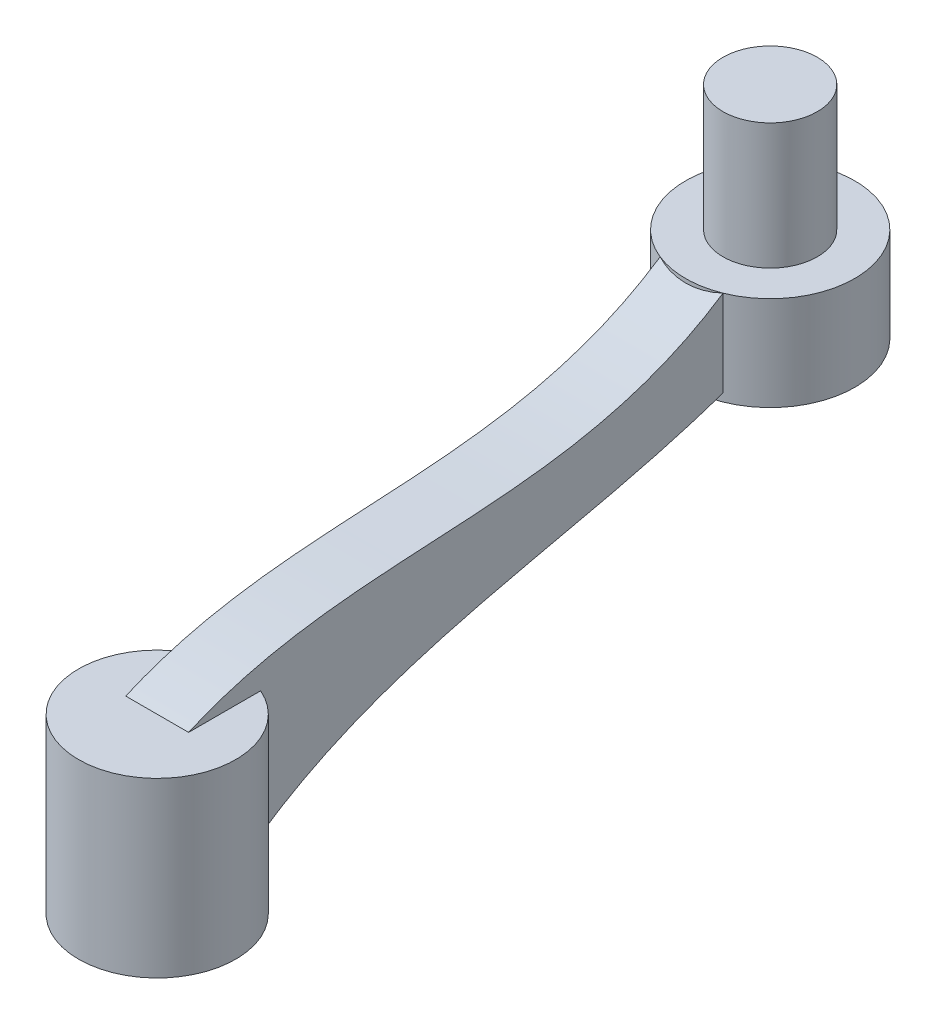
ISO-10303-21;
HEADER;
FILE_DESCRIPTION(('STEP AP214'),'2;1');
FILE_NAME('part.step','',(''),(''),'','','');
FILE_SCHEMA(('AUTOMOTIVE_DESIGN { 1 0 10303 214 1 1 1 1 }'));
ENDSEC;
DATA;
#1=APPLICATION_CONTEXT('core data for automotive mechanical design processes');
#2=APPLICATION_PROTOCOL_DEFINITION('international standard','automotive_design',2000,#1);
#3=PRODUCT_CONTEXT('',#1,'mechanical');
#4=PRODUCT('Part','Part','',(#3));
#5=PRODUCT_RELATED_PRODUCT_CATEGORY('part','',(#4));
#6=PRODUCT_DEFINITION_FORMATION('','',#4);
#7=PRODUCT_DEFINITION_CONTEXT('part definition',#1,'design');
#8=PRODUCT_DEFINITION('design','',#6,#7);
#9=PRODUCT_DEFINITION_SHAPE('','',#8);
#10=(LENGTH_UNIT() NAMED_UNIT(*) SI_UNIT(.MILLI.,.METRE.));
#11=(NAMED_UNIT(*) PLANE_ANGLE_UNIT() SI_UNIT($,.RADIAN.));
#12=(NAMED_UNIT(*) SI_UNIT($,.STERADIAN.) SOLID_ANGLE_UNIT());
#13=UNCERTAINTY_MEASURE_WITH_UNIT(LENGTH_MEASURE(1.E-05),#10,'distance_accuracy_value','');
#14=(GEOMETRIC_REPRESENTATION_CONTEXT(3) GLOBAL_UNCERTAINTY_ASSIGNED_CONTEXT((#13)) GLOBAL_UNIT_ASSIGNED_CONTEXT((#10,
#11,#12)) REPRESENTATION_CONTEXT('',''));
#15=CARTESIAN_POINT('',(0.,0.,0.));
#16=DIRECTION('',(0.,0.,1.));
#17=DIRECTION('',(1.,0.,0.));
#18=AXIS2_PLACEMENT_3D('',#15,#16,#17);
#19=CARTESIAN_POINT('',(0.,0.,0.));
#20=DIRECTION('',(0.,1.,0.));
#21=DIRECTION('',(0.,0.,1.));
#22=AXIS2_PLACEMENT_3D('',#19,#20,#21);
#23=PLANE('',#22);
#24=CARTESIAN_POINT('',(0.,0.,0.));
#25=DIRECTION('',(0.,1.,0.));
#26=DIRECTION('',(0.,0.,1.));
#27=AXIS2_PLACEMENT_3D('',#24,#25,#26);
#28=CIRCLE('',#27,12.5);
#29=CARTESIAN_POINT('',(0.,0.,12.5));
#30=VERTEX_POINT('',#29);
#31=EDGE_CURVE('E169',#30,#30,#28,.T.);
#32=ORIENTED_EDGE('',*,*,#31,.F.);
#33=EDGE_LOOP('',(#32));
#34=FACE_BOUND('',#33,.T.);
#35=CARTESIAN_POINT('',(0.,0.,0.));
#36=DIRECTION('',(0.,1.,0.));
#37=DIRECTION('',(0.,0.,1.));
#38=AXIS2_PLACEMENT_3D('',#35,#36,#37);
#39=CIRCLE('',#38,7.5005);
#40=CARTESIAN_POINT('',(0.,0.,7.5005));
#41=VERTEX_POINT('',#40);
#42=EDGE_CURVE('E172',#41,#41,#39,.T.);
#43=ORIENTED_EDGE('',*,*,#42,.T.);
#44=EDGE_LOOP('',(#43));
#45=FACE_BOUND('',#44,.T.);
#46=ADVANCED_FACE('F37',(#34,#45),#23,.F.);
#47=CARTESIAN_POINT('',(0.,25.,0.));
#48=DIRECTION('',(0.,-1.,0.));
#49=DIRECTION('',(0.,0.,-1.));
#50=AXIS2_PLACEMENT_3D('',#47,#48,#49);
#51=CYLINDRICAL_SURFACE('',#50,12.5);
#52=ORIENTED_EDGE('',*,*,#31,.T.);
#53=EDGE_LOOP('',(#52));
#54=FACE_BOUND('',#53,.T.);
#55=CARTESIAN_POINT('',(5.,7.72302915666088,-11.4564392373896));
#56=CARTESIAN_POINT('',(4.82360605867984,7.77585651611021,-11.5334330429258));
#57=CARTESIAN_POINT('',(4.64471114517457,7.82586968984376,-11.6066501763688));
#58=CARTESIAN_POINT('',(4.28234158306953,7.92015027105164,-11.7451747964378));
#59=CARTESIAN_POINT('',(4.09886564511888,7.96441603865194,-11.810480025252));
#60=CARTESIAN_POINT('',(3.72784421652486,8.04705708009227,-11.9327845511757));
#61=CARTESIAN_POINT('',(3.54029844148413,8.08543194075716,-11.9897832656705));
#62=CARTESIAN_POINT('',(3.16194868821997,8.15612417798314,-12.0950643256748));
#63=CARTESIAN_POINT('',(2.97114973476838,8.18845011009797,-12.143358978516));
#64=CARTESIAN_POINT('',(2.58660860137216,8.24701192008286,-12.2310399326026));
#65=CARTESIAN_POINT('',(2.39286672015294,8.27324841172546,-12.2704271316461));
#66=CARTESIAN_POINT('',(2.00303637312007,8.31955397950044,-12.3400591698015));
#67=CARTESIAN_POINT('',(1.80694800758855,8.3396233182285,-12.3703043981751));
#68=CARTESIAN_POINT('',(1.31380460073618,8.38207325826099,-12.4343497969015));
#69=CARTESIAN_POINT('',(1.01561990887161,8.40053044932752,-12.4622733851465));
#70=CARTESIAN_POINT('',(0.417476399256045,8.42322410248423,-12.4966175151259));
#71=CARTESIAN_POINT('',(0.117517601141777,8.42746072168108,-12.5030382944201));
#72=CARTESIAN_POINT('',(-0.381962093739761,8.42265525989415,-12.4957619537799));
#73=CARTESIAN_POINT('',(-0.581635702071715,8.41756844927359,-12.4880570355928));
#74=CARTESIAN_POINT('',(-0.980129392114079,8.40108407664962,-12.4631130730693));
#75=CARTESIAN_POINT('',(-1.17894949966061,8.38968670704865,-12.4458743194096));
#76=CARTESIAN_POINT('',(-1.57505942509754,8.3606178033558,-12.4019713586818));
#77=CARTESIAN_POINT('',(-1.7723494190541,8.34294700241393,-12.3753082530005));
#78=CARTESIAN_POINT('',(-2.14460428721626,8.30352486273387,-12.3159430418411));
#79=CARTESIAN_POINT('',(-2.31977841673824,8.28238009973192,-12.2841440460827));
#80=CARTESIAN_POINT('',(-2.66796160886924,8.23513896039721,-12.2132527429067));
#81=CARTESIAN_POINT('',(-2.84097077747262,8.20904282749772,-12.1741607940475));
#82=CARTESIAN_POINT('',(-3.18441637286958,8.15196132871038,-12.0888709556859));
#83=CARTESIAN_POINT('',(-3.35485270910427,8.12097579116224,-12.0426728166962));
#84=CARTESIAN_POINT('',(-3.69284885158456,8.05417140609621,-11.9433627608033));
#85=CARTESIAN_POINT('',(-3.86040691368029,8.0183497369362,-11.8902468083437));
#86=CARTESIAN_POINT('',(-4.19216554411137,7.94197236502252,-11.7773698188803));
#87=CARTESIAN_POINT('',(-4.35636617953836,7.90141675697627,-11.717608914817));
#88=CARTESIAN_POINT('',(-4.68104951558159,7.81567351032977,-11.59172650137));
#89=CARTESIAN_POINT('',(-4.8415327682053,7.77048656492975,-11.5256059439651));
#90=CARTESIAN_POINT('',(-5.,7.72302915666087,-11.4564392373896));
#91=B_SPLINE_CURVE_WITH_KNOTS('',3,(#55,#56,#57,#58,#59,#60,#61,#62,#63,#64,#65,#66,#67,#68,#69,
#70,#71,#72,#73,#74,#75,#76,#77,#78,#79,#80,#81,#82,#83,#84,#85,#86,#87,#88,#89,#90),
.UNSPECIFIED.,.F.,.F.,(4,2,2,2,2,2,2,2,2,2,2,2,2,2,2,2,2,4),(0.,0.598692499053634,
1.19755544592288,1.79646037653874,2.3945117101697,2.99250273825321,3.59046830051425,
4.48948639454883,5.38849455633737,5.9878528998766,6.58719297060329,7.18646302197683,
7.72410059316368,8.26171173833455,8.7993417624965,9.33728683368178,9.87522114455633,
10.413075056813),.UNSPECIFIED.);
#92=CARTESIAN_POINT('',(5.,7.72302915666044,-11.456439237389));
#93=VERTEX_POINT('',#92);
#94=CARTESIAN_POINT('',(-5.,7.72302915666044,-11.456439237389));
#95=VERTEX_POINT('',#94);
#96=EDGE_CURVE('E46',#93,#95,#91,.T.);
#97=ORIENTED_EDGE('',*,*,#96,.F.);
#98=DIRECTION('',(0.,-1.,0.));
#99=VECTOR('',#98,1.);
#100=CARTESIAN_POINT('',(5.,25.,-11.4564392373896));
#101=LINE('',#100,#99);
#102=CARTESIAN_POINT('',(5.,27.5,-11.4564392373896));
#103=VERTEX_POINT('',#102);
#104=EDGE_CURVE('E90',#93,#103,#101,.F.);
#105=ORIENTED_EDGE('',*,*,#104,.T.);
#106=CARTESIAN_POINT('',(0.,27.5,0.));
#107=DIRECTION('',(0.,1.,0.));
#108=DIRECTION('',(0.,0.,1.));
#109=AXIS2_PLACEMENT_3D('',#106,#107,#108);
#110=CIRCLE('',#109,12.5);
#111=CARTESIAN_POINT('',(-5.,27.5,-11.4564392373896));
#112=VERTEX_POINT('',#111);
#113=EDGE_CURVE('E179',#112,#103,#110,.T.);
#114=ORIENTED_EDGE('',*,*,#113,.F.);
#115=DIRECTION('',(0.,-1.,0.));
#116=VECTOR('',#115,1.);
#117=CARTESIAN_POINT('',(-5.,25.,-11.4564392373896));
#118=LINE('',#117,#116);
#119=EDGE_CURVE('E194',#95,#112,#118,.F.);
#120=ORIENTED_EDGE('',*,*,#119,.F.);
#121=EDGE_LOOP('',(#97,#105,#114,#120));
#122=FACE_BOUND('',#121,.T.);
#123=ADVANCED_FACE('F39',(#54,#122),#51,.T.);
#124=CARTESIAN_POINT('',(0.,25.,0.));
#125=DIRECTION('',(0.,-1.,0.));
#126=DIRECTION('',(0.,0.,-1.));
#127=AXIS2_PLACEMENT_3D('',#124,#125,#126);
#128=CYLINDRICAL_SURFACE('',#127,7.5005);
#129=CARTESIAN_POINT('',(0.,25.,0.));
#130=DIRECTION('',(0.,1.,0.));
#131=DIRECTION('',(0.,0.,1.));
#132=AXIS2_PLACEMENT_3D('',#129,#130,#131);
#133=CIRCLE('',#132,7.5005);
#134=CARTESIAN_POINT('',(0.,25.,7.5005));
#135=VERTEX_POINT('',#134);
#136=EDGE_CURVE('E174',#135,#135,#133,.T.);
#137=ORIENTED_EDGE('',*,*,#136,.T.);
#138=EDGE_LOOP('',(#137));
#139=FACE_BOUND('',#138,.T.);
#140=ORIENTED_EDGE('',*,*,#42,.F.);
#141=EDGE_LOOP('',(#140));
#142=FACE_BOUND('',#141,.T.);
#143=ADVANCED_FACE('F156',(#139,#142),#128,.F.);
#144=CARTESIAN_POINT('',(0.,25.,0.));
#145=DIRECTION('',(0.,1.,0.));
#146=DIRECTION('',(0.,0.,1.));
#147=AXIS2_PLACEMENT_3D('',#144,#145,#146);
#148=PLANE('',#147);
#149=ORIENTED_EDGE('',*,*,#136,.F.);
#150=EDGE_LOOP('',(#149));
#151=FACE_BOUND('',#150,.T.);
#152=ADVANCED_FACE('F152',(#151),#148,.F.);
#153=CARTESIAN_POINT('',(0.,27.5,0.));
#154=DIRECTION('',(0.,1.,0.));
#155=DIRECTION('',(0.,0.,1.));
#156=AXIS2_PLACEMENT_3D('',#153,#154,#155);
#157=PLANE('',#156);
#158=DIRECTION('',(0.,0.,-1.));
#159=VECTOR('',#158,1.);
#160=CARTESIAN_POINT('',(5.,27.5,0.));
#161=LINE('',#160,#159);
#162=CARTESIAN_POINT('',(5.,27.5,0.));
#163=VERTEX_POINT('',#162);
#164=EDGE_CURVE('E185',#163,#103,#161,.T.);
#165=ORIENTED_EDGE('',*,*,#164,.F.);
#166=DIRECTION('',(-1.,0.,0.));
#167=VECTOR('',#166,1.);
#168=CARTESIAN_POINT('',(5.,27.5,0.));
#169=LINE('',#168,#167);
#170=CARTESIAN_POINT('',(-5.,27.5,0.));
#171=VERTEX_POINT('',#170);
#172=EDGE_CURVE('E93',#163,#171,#169,.T.);
#173=ORIENTED_EDGE('',*,*,#172,.T.);
#174=DIRECTION('',(0.,0.,-1.));
#175=VECTOR('',#174,1.);
#176=CARTESIAN_POINT('',(-5.,27.5,0.));
#177=LINE('',#176,#175);
#178=EDGE_CURVE('E176',#171,#112,#177,.T.);
#179=ORIENTED_EDGE('',*,*,#178,.T.);
#180=ORIENTED_EDGE('',*,*,#113,.T.);
#181=EDGE_LOOP('',(#165,#173,#179,#180));
#182=FACE_BOUND('',#181,.T.);
#183=ADVANCED_FACE('F149',(#182),#157,.T.);
#184=CARTESIAN_POINT('',(5.,6.7529613324093,-10.0785582777186));
#185=CARTESIAN_POINT('',(5.,28.5152283951701,-40.20750670593));
#186=CARTESIAN_POINT('',(5.,21.3775725342741,-81.426628226541));
#187=CARTESIAN_POINT('',(5.,45.5,-110.));
#188=B_SPLINE_CURVE_WITH_KNOTS('',3,(#184,#185,#186,#187),.UNSPECIFIED.,.F.,.F.,(4,4),(0.,1.),.UNSPECIFIED.);
#189=DIRECTION('',(-1.,0.,0.));
#190=VECTOR('',#189,1.);
#191=SURFACE_OF_LINEAR_EXTRUSION('',#188,#190);
#192=CARTESIAN_POINT('',(-5.,6.7529613324093,-10.0785582777186));
#193=CARTESIAN_POINT('',(-5.,28.5152283951701,-40.20750670593));
#194=CARTESIAN_POINT('',(-5.,21.3775725342741,-81.426628226541));
#195=CARTESIAN_POINT('',(-5.,45.5,-110.));
#196=B_SPLINE_CURVE_WITH_KNOTS('',3,(#192,#193,#194,#195),.UNSPECIFIED.,.F.,.F.,(4,4),(0.,1.),.UNSPECIFIED.);
#197=CARTESIAN_POINT('',(-5.,31.7672129650439,-84.9999999957818));
#198=VERTEX_POINT('',#197);
#199=EDGE_CURVE('E100',#95,#198,#196,.T.);
#200=ORIENTED_EDGE('',*,*,#199,.T.);
#201=CARTESIAN_POINT('',(-5.,31.7672129665196,-85.));
#202=CARTESIAN_POINT('',(-4.77917072689228,31.7363091782433,-84.9116582703728));
#203=CARTESIAN_POINT('',(-4.55573425431743,31.7075389800109,-84.8290817700165));
#204=CARTESIAN_POINT('',(-4.1043244666759,31.6542864216685,-84.6757543171618));
#205=CARTESIAN_POINT('',(-3.87635089109876,31.6298043085666,-84.6050040459044));
#206=CARTESIAN_POINT('',(-3.41656622203768,31.5851517714692,-84.4756333079618));
#207=CARTESIAN_POINT('',(-3.18475506479095,31.5649814191929,-84.41701304304));
#208=CARTESIAN_POINT('',(-2.71793883264543,31.5289638310983,-84.3121246803194));
#209=CARTESIAN_POINT('',(-2.4829326784607,31.5131180962696,-84.2658608713221));
#210=CARTESIAN_POINT('',(-2.01054736164585,31.4857732316139,-84.1859068498647));
#211=CARTESIAN_POINT('',(-1.7731683093338,31.4742739006747,-84.1522160556402));
#212=CARTESIAN_POINT('',(-1.29680609269533,31.4556309974567,-84.097545493657));
#213=CARTESIAN_POINT('',(-1.05782299979407,31.4484872325159,-84.0765651636702));
#214=CARTESIAN_POINT('',(-0.458907061815854,31.4360727266357,-84.0400953182424));
#215=CARTESIAN_POINT('',(-0.0983941459926912,31.4335358061497,-84.032629664027));
#216=CARTESIAN_POINT('',(0.622019030037122,31.4383012689281,-84.0466382324008));
#217=CARTESIAN_POINT('',(0.98191920457573,31.4456049303717,-84.0681162144378));
#218=CARTESIAN_POINT('',(1.69792061764954,31.4700175388413,-84.1397495125988));
#219=CARTESIAN_POINT('',(2.05402713359381,31.4871103286708,-84.1898575737578));
#220=CARTESIAN_POINT('',(2.76037325845269,31.5310498589831,-84.3182276426731));
#221=CARTESIAN_POINT('',(3.1106153758542,31.5578923114719,-84.3964772733517));
#222=CARTESIAN_POINT('',(3.71952708176473,31.6136418262169,-84.5582433297548));
#223=CARTESIAN_POINT('',(3.97994495480091,31.6404965023567,-84.6359577351803));
#224=CARTESIAN_POINT('',(4.49468578077806,31.6997242712266,-84.8066434571198));
#225=CARTESIAN_POINT('',(4.74901668923109,31.7320896552925,-84.8995934546093));
#226=CARTESIAN_POINT('',(5.,31.7672129665196,-85.));
#227=B_SPLINE_CURVE_WITH_KNOTS('',3,(#201,#202,#203,#204,#205,#206,#207,#208,#209,#210,#211,
#212,#213,#214,#215,#216,#217,#218,#219,#220,#221,#222,#223,#224,#225,#226),.UNSPECIFIED.,.F.,
.F.,(4,2,2,2,2,2,2,2,2,2,2,2,4),(0.,0.71944095390759,1.43892333639197,2.15841768535485,
2.878161439981,3.59787188730885,4.31755049701933,5.39797478622302,6.47853942373389,
7.55732568178956,8.63563805280323,9.45438070139367,10.2719873208564),.UNSPECIFIED.);
#228=CARTESIAN_POINT('',(5.,31.7672129650439,-85.));
#229=VERTEX_POINT('',#228);
#230=EDGE_CURVE('E97',#198,#229,#227,.T.);
#231=ORIENTED_EDGE('',*,*,#230,.T.);
#232=EDGE_CURVE('E83',#93,#229,#188,.T.);
#233=ORIENTED_EDGE('',*,*,#232,.F.);
#234=ORIENTED_EDGE('',*,*,#96,.T.);
#235=EDGE_LOOP('',(#200,#231,#233,#234));
#236=FACE_BOUND('',#235,.T.);
#237=ADVANCED_FACE('F98',(#236),#191,.F.);
#238=CARTESIAN_POINT('',(5.,34.6054192875025,-43.1369025098293));
#239=DIRECTION('',(1.,0.,0.));
#240=DIRECTION('',(0.,0.,-1.));
#241=AXIS2_PLACEMENT_3D('',#238,#239,#240);
#242=PLANE('',#241);
#243=DIRECTION('',(0.,1.,0.));
#244=VECTOR('',#243,1.);
#245=CARTESIAN_POINT('',(5.,30.5,-85.));
#246=LINE('',#245,#244);
#247=CARTESIAN_POINT('',(5.,45.5,-85.));
#248=VERTEX_POINT('',#247);
#249=EDGE_CURVE('E87',#248,#229,#246,.F.);
#250=ORIENTED_EDGE('',*,*,#249,.F.);
#251=CARTESIAN_POINT('',(5.,45.5,-85.));
#252=CARTESIAN_POINT('',(5.,28.4666171728128,-59.3800642574351));
#253=CARTESIAN_POINT('',(5.,39.4811675938606,-27.3183424354431));
#254=CARTESIAN_POINT('',(5.,27.5,0.));
#255=B_SPLINE_CURVE_WITH_KNOTS('',3,(#251,#252,#253,#254),.UNSPECIFIED.,.F.,.F.,(4,4),(0.,1.),.UNSPECIFIED.);
#256=EDGE_CURVE('E94',#248,#163,#255,.T.);
#257=ORIENTED_EDGE('',*,*,#256,.T.);
#258=ORIENTED_EDGE('',*,*,#164,.T.);
#259=ORIENTED_EDGE('',*,*,#104,.F.);
#260=ORIENTED_EDGE('',*,*,#232,.T.);
#261=EDGE_LOOP('',(#250,#257,#258,#259,#260));
#262=FACE_BOUND('',#261,.T.);
#263=ADVANCED_FACE('F85',(#262),#242,.T.);
#264=CARTESIAN_POINT('',(-5.,34.6054192875025,-43.1369025098293));
#265=DIRECTION('',(1.,0.,0.));
#266=DIRECTION('',(0.,0.,-1.));
#267=AXIS2_PLACEMENT_3D('',#264,#265,#266);
#268=PLANE('',#267);
#269=CARTESIAN_POINT('',(-5.,45.5,-85.));
#270=CARTESIAN_POINT('',(-5.,28.4666171728128,-59.3800642574351));
#271=CARTESIAN_POINT('',(-5.,39.4811675938606,-27.3183424354431));
#272=CARTESIAN_POINT('',(-5.,27.5,0.));
#273=B_SPLINE_CURVE_WITH_KNOTS('',3,(#269,#270,#271,#272),.UNSPECIFIED.,.F.,.F.,(4,4),(0.,1.),.UNSPECIFIED.);
#274=CARTESIAN_POINT('',(-5.,45.5,-85.));
#275=VERTEX_POINT('',#274);
#276=EDGE_CURVE('E102',#275,#171,#273,.T.);
#277=ORIENTED_EDGE('',*,*,#276,.F.);
#278=DIRECTION('',(0.,1.,0.));
#279=VECTOR('',#278,1.);
#280=CARTESIAN_POINT('',(-5.,30.5,-85.));
#281=LINE('',#280,#279);
#282=EDGE_CURVE('E105',#275,#198,#281,.F.);
#283=ORIENTED_EDGE('',*,*,#282,.T.);
#284=ORIENTED_EDGE('',*,*,#199,.F.);
#285=ORIENTED_EDGE('',*,*,#119,.T.);
#286=ORIENTED_EDGE('',*,*,#178,.F.);
#287=EDGE_LOOP('',(#277,#283,#284,#285,#286));
#288=FACE_BOUND('',#287,.T.);
#289=ADVANCED_FACE('F147',(#288),#268,.F.);
#290=DIRECTION('',(-1.,0.,0.));
#291=VECTOR('',#290,1.);
#292=SURFACE_OF_LINEAR_EXTRUSION('',#255,#291);
#293=ORIENTED_EDGE('',*,*,#256,.F.);
#294=CARTESIAN_POINT('',(5.,45.5,-85.));
#295=CARTESIAN_POINT('',(4.80550644981999,45.4482721940787,-84.9221917839187));
#296=CARTESIAN_POINT('',(4.60846568523318,45.3996747121654,-84.8486518071905));
#297=CARTESIAN_POINT('',(4.20981506664305,45.308803230734,-84.7104770489836));
#298=CARTESIAN_POINT('',(4.00820439463017,45.266530373777,-84.6458438767099));
#299=CARTESIAN_POINT('',(3.60100103640037,45.188387995651,-84.5258771889517));
#300=CARTESIAN_POINT('',(3.39540817735329,45.1525187530975,-84.4705440781105));
#301=CARTESIAN_POINT('',(2.98102532875277,45.0872672636349,-84.3695420119284));
#302=CARTESIAN_POINT('',(2.77223803598264,45.0578798364126,-84.323865340313));
#303=CARTESIAN_POINT('',(2.35195158496019,45.0056017354038,-84.242393329151));
#304=CARTESIAN_POINT('',(2.14045263523875,44.9827105651394,-84.206597234485));
#305=CARTESIAN_POINT('',(1.71541395002479,44.9434565436038,-84.1450952606238));
#306=CARTESIAN_POINT('',(1.50187430209172,44.9270934135127,-84.1193889504836));
#307=CARTESIAN_POINT('',(0.965722704962715,44.8943407201989,-84.0678788336958));
#308=CARTESIAN_POINT('',(0.642207919708919,44.8820674729882,-84.0485135998241));
#309=CARTESIAN_POINT('',(-0.00561065831386368,44.8723520697489,-84.0331888325174));
#310=CARTESIAN_POINT('',(-0.329914554284796,44.8749119708226,-84.0372325455002));
#311=CARTESIAN_POINT('',(-0.97670478244103,44.8948517642445,-84.0686650149387));
#312=CARTESIAN_POINT('',(-1.29919229670229,44.9122205254104,-84.0960362371039));
#313=CARTESIAN_POINT('',(-1.94012098084985,44.9616921266387,-84.1737028316162));
#314=CARTESIAN_POINT('',(-2.25856311814445,44.9937913732059,-84.2239926129702));
#315=CARTESIAN_POINT('',(-2.99260345616442,45.0855564608589,-84.3669906671882));
#316=CARTESIAN_POINT('',(-3.40591241960259,45.1508047448123,-84.4681930853562));
#317=CARTESIAN_POINT('',(-4.01359357543639,45.2676391914923,-84.647538569093));
#318=CARTESIAN_POINT('',(-4.21404414098669,45.3097276889849,-84.7118854772809));
#319=CARTESIAN_POINT('',(-4.61048556453089,45.4001753181538,-84.8494102422438));
#320=CARTESIAN_POINT('',(-4.80647578390677,45.4485353412097,-84.9225893542479));
#321=CARTESIAN_POINT('',(-5.,45.5,-85.));
#322=B_SPLINE_CURVE_WITH_KNOTS('',3,(#294,#295,#296,#297,#298,#299,#300,#301,#302,#303,#304,
#305,#306,#307,#308,#309,#310,#311,#312,#313,#314,#315,#316,#317,#318,#319,#320,#321),
.UNSPECIFIED.,.F.,.F.,(4,2,2,2,2,2,2,2,2,2,2,2,2,4),(0.,0.647246493599695,1.29460977325514,
1.94200121224036,2.58887336133509,3.23569605976818,3.88249112872904,4.85421427902541,
5.82607219381745,6.79720024822479,7.7680915222123,9.05653912152311,9.70034710894896,
10.3442467020791),.UNSPECIFIED.);
#323=EDGE_CURVE('E107',#248,#275,#322,.T.);
#324=ORIENTED_EDGE('',*,*,#323,.T.);
#325=ORIENTED_EDGE('',*,*,#276,.T.);
#326=ORIENTED_EDGE('',*,*,#172,.F.);
#327=EDGE_LOOP('',(#293,#324,#325,#326));
#328=FACE_BOUND('',#327,.T.);
#329=ADVANCED_FACE('F143',(#328),#292,.F.);
#330=CARTESIAN_POINT('',(0.,30.5,-97.5));
#331=DIRECTION('',(0.,1.,0.));
#332=DIRECTION('',(0.,0.,1.));
#333=AXIS2_PLACEMENT_3D('',#330,#331,#332);
#334=CYLINDRICAL_SURFACE('',#333,13.4629120178363);
#335=ORIENTED_EDGE('',*,*,#323,.F.);
#336=CARTESIAN_POINT('',(0.,45.5,-97.5));
#337=DIRECTION('',(0.,1.,0.));
#338=DIRECTION('',(0.,0.,1.));
#339=AXIS2_PLACEMENT_3D('',#336,#337,#338);
#340=CIRCLE('',#339,13.4629120178363);
#341=EDGE_CURVE('E141',#275,#248,#340,.T.);
#342=ORIENTED_EDGE('',*,*,#341,.F.);
#343=EDGE_LOOP('',(#335,#342));
#344=FACE_BOUND('',#343,.T.);
#345=ADVANCED_FACE('F130',(#344),#334,.T.);
#346=CARTESIAN_POINT('',(5.,45.5,-110.));
#347=DIRECTION('',(0.,-1.,0.));
#348=DIRECTION('',(0.,0.,-1.));
#349=AXIS2_PLACEMENT_3D('',#346,#347,#348);
#350=PLANE('',#349);
#351=CARTESIAN_POINT('',(0.,45.5,-97.5));
#352=DIRECTION('',(0.,-1.,0.));
#353=DIRECTION('',(0.,0.,-1.));
#354=AXIS2_PLACEMENT_3D('',#351,#352,#353);
#355=CIRCLE('',#354,7.50000000000001);
#356=CARTESIAN_POINT('',(0.,45.5,-105.));
#357=VERTEX_POINT('',#356);
#358=EDGE_CURVE('E11',#357,#357,#355,.F.);
#359=ORIENTED_EDGE('',*,*,#358,.F.);
#360=EDGE_LOOP('',(#359));
#361=FACE_BOUND('',#360,.T.);
#362=ORIENTED_EDGE('',*,*,#341,.T.);
#363=EDGE_CURVE('E52',#248,#275,#340,.T.);
#364=ORIENTED_EDGE('',*,*,#363,.T.);
#365=EDGE_LOOP('',(#362,#364));
#366=FACE_BOUND('',#365,.T.);
#367=ADVANCED_FACE('F128',(#361,#366),#350,.F.);
#368=CARTESIAN_POINT('',(0.,30.5,-97.5));
#369=DIRECTION('',(0.,1.,0.));
#370=DIRECTION('',(0.,0.,1.));
#371=AXIS2_PLACEMENT_3D('',#368,#369,#370);
#372=CIRCLE('',#371,13.4629120178363);
#373=CARTESIAN_POINT('',(0.,30.5,-84.0370879821637));
#374=VERTEX_POINT('',#373);
#375=EDGE_CURVE('E140',#374,#374,#372,.T.);
#376=ORIENTED_EDGE('',*,*,#375,.T.);
#377=EDGE_LOOP('',(#376));
#378=FACE_BOUND('',#377,.T.);
#379=ORIENTED_EDGE('',*,*,#230,.F.);
#380=ORIENTED_EDGE('',*,*,#282,.F.);
#381=ORIENTED_EDGE('',*,*,#363,.F.);
#382=ORIENTED_EDGE('',*,*,#249,.T.);
#383=EDGE_LOOP('',(#379,#380,#381,#382));
#384=FACE_BOUND('',#383,.T.);
#385=ADVANCED_FACE('F104',(#378,#384),#334,.T.);
#386=CARTESIAN_POINT('',(0.,30.5,-97.5));
#387=DIRECTION('',(0.,1.,0.));
#388=DIRECTION('',(0.,0.,1.));
#389=AXIS2_PLACEMENT_3D('',#386,#387,#388);
#390=PLANE('',#389);
#391=ORIENTED_EDGE('',*,*,#375,.F.);
#392=EDGE_LOOP('',(#391));
#393=FACE_BOUND('',#392,.T.);
#394=ADVANCED_FACE('F127',(#393),#390,.F.);
#395=CARTESIAN_POINT('',(0.,65.5,-97.5));
#396=DIRECTION('',(0.,-1.,0.));
#397=DIRECTION('',(0.,0.,-1.));
#398=AXIS2_PLACEMENT_3D('',#395,#396,#397);
#399=CYLINDRICAL_SURFACE('',#398,7.50000000000001);
#400=CARTESIAN_POINT('',(0.,65.5,-97.5));
#401=DIRECTION('',(0.,1.,0.));
#402=DIRECTION('',(0.,0.,1.));
#403=AXIS2_PLACEMENT_3D('',#400,#401,#402);
#404=CIRCLE('',#403,7.50000000000001);
#405=CARTESIAN_POINT('',(0.,65.5,-90.));
#406=VERTEX_POINT('',#405);
#407=EDGE_CURVE('E224',#406,#406,#404,.T.);
#408=ORIENTED_EDGE('',*,*,#407,.F.);
#409=EDGE_LOOP('',(#408));
#410=FACE_BOUND('',#409,.T.);
#411=ORIENTED_EDGE('',*,*,#358,.T.);
#412=EDGE_LOOP('',(#411));
#413=FACE_BOUND('',#412,.T.);
#414=ADVANCED_FACE('F233',(#410,#413),#399,.T.);
#415=CARTESIAN_POINT('',(0.,65.5,-97.5));
#416=DIRECTION('',(0.,1.,0.));
#417=DIRECTION('',(0.,0.,1.));
#418=AXIS2_PLACEMENT_3D('',#415,#416,#417);
#419=PLANE('',#418);
#420=ORIENTED_EDGE('',*,*,#407,.T.);
#421=EDGE_LOOP('',(#420));
#422=FACE_BOUND('',#421,.T.);
#423=ADVANCED_FACE('F237',(#422),#419,.T.);
#424=CLOSED_SHELL('',(#46,#123,#143,#152,#183,#237,#263,#289,#329,#345,#367,#385,#394,#414,#423));
#425=MANIFOLD_SOLID_BREP('B2',#424);
#426=ADVANCED_BREP_SHAPE_REPRESENTATION('',(#18,#425),#14);
#427=SHAPE_DEFINITION_REPRESENTATION(#9,#426);
ENDSEC;
END-ISO-10303-21;
